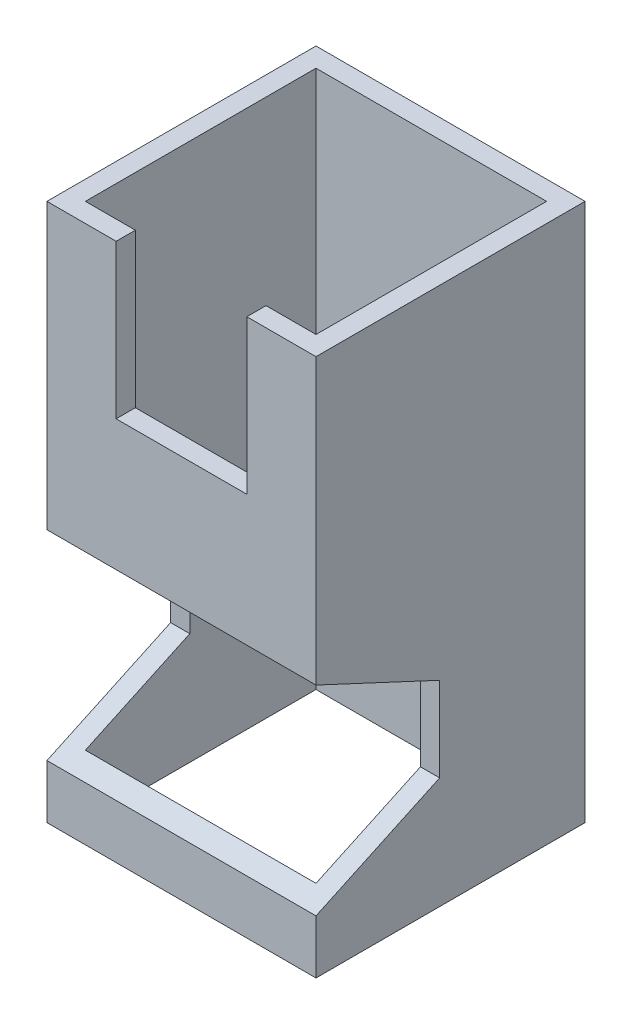
ISO-10303-21;
HEADER;
FILE_DESCRIPTION(('STEP AP214'),'2;1');
FILE_NAME('part.step','',(''),(''),'','','');
FILE_SCHEMA(('AUTOMOTIVE_DESIGN { 1 0 10303 214 1 1 1 1 }'));
ENDSEC;
DATA;
#1=APPLICATION_CONTEXT('core data for automotive mechanical design processes');
#2=APPLICATION_PROTOCOL_DEFINITION('international standard','automotive_design',2000,#1);
#3=PRODUCT_CONTEXT('',#1,'mechanical');
#4=PRODUCT('Part','Part','',(#3));
#5=PRODUCT_RELATED_PRODUCT_CATEGORY('part','',(#4));
#6=PRODUCT_DEFINITION_FORMATION('','',#4);
#7=PRODUCT_DEFINITION_CONTEXT('part definition',#1,'design');
#8=PRODUCT_DEFINITION('design','',#6,#7);
#9=PRODUCT_DEFINITION_SHAPE('','',#8);
#10=(LENGTH_UNIT() NAMED_UNIT(*) SI_UNIT(.MILLI.,.METRE.));
#11=(NAMED_UNIT(*) PLANE_ANGLE_UNIT() SI_UNIT($,.RADIAN.));
#12=(NAMED_UNIT(*) SI_UNIT($,.STERADIAN.) SOLID_ANGLE_UNIT());
#13=UNCERTAINTY_MEASURE_WITH_UNIT(LENGTH_MEASURE(1.E-05),#10,'distance_accuracy_value','');
#14=(GEOMETRIC_REPRESENTATION_CONTEXT(3) GLOBAL_UNCERTAINTY_ASSIGNED_CONTEXT((#13)) GLOBAL_UNIT_ASSIGNED_CONTEXT((#10,
#11,#12)) REPRESENTATION_CONTEXT('',''));
#15=CARTESIAN_POINT('',(0.,0.,0.));
#16=DIRECTION('',(0.,0.,1.));
#17=DIRECTION('',(1.,0.,0.));
#18=AXIS2_PLACEMENT_3D('',#15,#16,#17);
#19=CARTESIAN_POINT('',(-2.5,70.,2.5));
#20=DIRECTION('',(0.,0.,-1.));
#21=DIRECTION('',(-1.,0.,0.));
#22=AXIS2_PLACEMENT_3D('',#19,#20,#21);
#23=PLANE('',#22);
#24=DIRECTION('',(0.,-1.,0.));
#25=VECTOR('',#24,1.);
#26=CARTESIAN_POINT('',(32.5,70.,2.5));
#27=LINE('',#26,#25);
#28=CARTESIAN_POINT('',(32.5,7.,2.5));
#29=VERTEX_POINT('',#28);
#30=CARTESIAN_POINT('',(32.5,0.,2.5));
#31=VERTEX_POINT('',#30);
#32=EDGE_CURVE('E202',#29,#31,#27,.T.);
#33=ORIENTED_EDGE('',*,*,#32,.F.);
#34=DIRECTION('',(-1.,0.,0.));
#35=VECTOR('',#34,1.);
#36=CARTESIAN_POINT('',(32.5,7.,2.5));
#37=LINE('',#36,#35);
#38=CARTESIAN_POINT('',(-2.5,7.,2.5));
#39=VERTEX_POINT('',#38);
#40=EDGE_CURVE('E221',#29,#39,#37,.T.);
#41=ORIENTED_EDGE('',*,*,#40,.T.);
#42=DIRECTION('',(0.,-1.,0.));
#43=VECTOR('',#42,1.);
#44=CARTESIAN_POINT('',(-2.5,70.,2.5));
#45=LINE('',#44,#43);
#46=CARTESIAN_POINT('',(-2.5,0.,2.5));
#47=VERTEX_POINT('',#46);
#48=EDGE_CURVE('E201',#39,#47,#45,.T.);
#49=ORIENTED_EDGE('',*,*,#48,.T.);
#50=DIRECTION('',(1.,0.,0.));
#51=VECTOR('',#50,1.);
#52=CARTESIAN_POINT('',(-2.5,0.,2.5));
#53=LINE('',#52,#51);
#54=EDGE_CURVE('E260',#47,#31,#53,.T.);
#55=ORIENTED_EDGE('',*,*,#54,.T.);
#56=EDGE_LOOP('',(#33,#41,#49,#55));
#57=FACE_BOUND('',#56,.T.);
#58=ADVANCED_FACE('F40',(#57),#23,.F.);
#59=CARTESIAN_POINT('',(0.,70.,0.));
#60=DIRECTION('',(0.,0.,-1.));
#61=DIRECTION('',(-1.,0.,0.));
#62=AXIS2_PLACEMENT_3D('',#59,#60,#61);
#63=PLANE('',#62);
#64=DIRECTION('',(-1.,0.,0.));
#65=VECTOR('',#64,1.);
#66=CARTESIAN_POINT('',(0.,8.16576914538749,0.));
#67=LINE('',#66,#65);
#68=CARTESIAN_POINT('',(30.,8.16576914538748,0.));
#69=VERTEX_POINT('',#68);
#70=CARTESIAN_POINT('',(0.,8.16576914538749,0.));
#71=VERTEX_POINT('',#70);
#72=EDGE_CURVE('E296',#69,#71,#67,.T.);
#73=ORIENTED_EDGE('',*,*,#72,.F.);
#74=DIRECTION('',(0.,-1.,0.));
#75=VECTOR('',#74,1.);
#76=CARTESIAN_POINT('',(30.,70.,0.));
#77=LINE('',#76,#75);
#78=CARTESIAN_POINT('',(30.,0.,0.));
#79=VERTEX_POINT('',#78);
#80=EDGE_CURVE('E227',#69,#79,#77,.T.);
#81=ORIENTED_EDGE('',*,*,#80,.T.);
#82=DIRECTION('',(1.,0.,0.));
#83=VECTOR('',#82,1.);
#84=CARTESIAN_POINT('',(0.,0.,0.));
#85=LINE('',#84,#83);
#86=CARTESIAN_POINT('',(0.,0.,0.));
#87=VERTEX_POINT('',#86);
#88=EDGE_CURVE('E341',#87,#79,#85,.T.);
#89=ORIENTED_EDGE('',*,*,#88,.F.);
#90=DIRECTION('',(0.,-1.,0.));
#91=VECTOR('',#90,1.);
#92=CARTESIAN_POINT('',(0.,70.,0.));
#93=LINE('',#92,#91);
#94=EDGE_CURVE('E237',#71,#87,#93,.T.);
#95=ORIENTED_EDGE('',*,*,#94,.F.);
#96=EDGE_LOOP('',(#73,#81,#89,#95));
#97=FACE_BOUND('',#96,.T.);
#98=ADVANCED_FACE('F354',(#97),#63,.T.);
#99=CARTESIAN_POINT('',(0.,70.,0.));
#100=DIRECTION('',(0.,1.,0.));
#101=DIRECTION('',(0.,0.,1.));
#102=AXIS2_PLACEMENT_3D('',#99,#100,#101);
#103=PLANE('',#102);
#104=DIRECTION('',(0.,0.,1.));
#105=VECTOR('',#104,1.);
#106=CARTESIAN_POINT('',(23.5,70.,-26.2488094968134));
#107=LINE('',#106,#105);
#108=CARTESIAN_POINT('',(23.5,70.,0.));
#109=VERTEX_POINT('',#108);
#110=CARTESIAN_POINT('',(23.5,70.,2.5));
#111=VERTEX_POINT('',#110);
#112=EDGE_CURVE('E320',#109,#111,#107,.T.);
#113=ORIENTED_EDGE('',*,*,#112,.T.);
#114=DIRECTION('',(1.,0.,0.));
#115=VECTOR('',#114,1.);
#116=CARTESIAN_POINT('',(-2.5,70.,2.5));
#117=LINE('',#116,#115);
#118=CARTESIAN_POINT('',(32.5,70.,2.5));
#119=VERTEX_POINT('',#118);
#120=EDGE_CURVE('E249',#111,#119,#117,.T.);
#121=ORIENTED_EDGE('',*,*,#120,.T.);
#122=DIRECTION('',(0.,0.,-1.));
#123=VECTOR('',#122,1.);
#124=CARTESIAN_POINT('',(32.5,70.,-32.5));
#125=LINE('',#124,#123);
#126=CARTESIAN_POINT('',(32.5,70.,-32.5));
#127=VERTEX_POINT('',#126);
#128=EDGE_CURVE('E200',#119,#127,#125,.T.);
#129=ORIENTED_EDGE('',*,*,#128,.T.);
#130=DIRECTION('',(-1.,0.,0.));
#131=VECTOR('',#130,1.);
#132=CARTESIAN_POINT('',(-2.5,70.,-32.5));
#133=LINE('',#132,#131);
#134=CARTESIAN_POINT('',(-2.5,70.,-32.5));
#135=VERTEX_POINT('',#134);
#136=EDGE_CURVE('E255',#127,#135,#133,.T.);
#137=ORIENTED_EDGE('',*,*,#136,.T.);
#138=DIRECTION('',(0.,0.,1.));
#139=VECTOR('',#138,1.);
#140=CARTESIAN_POINT('',(-2.5,70.,-32.5));
#141=LINE('',#140,#139);
#142=CARTESIAN_POINT('',(-2.5,70.,2.5));
#143=VERTEX_POINT('',#142);
#144=EDGE_CURVE('E246',#135,#143,#141,.T.);
#145=ORIENTED_EDGE('',*,*,#144,.T.);
#146=CARTESIAN_POINT('',(6.5,70.,2.5));
#147=VERTEX_POINT('',#146);
#148=EDGE_CURVE('E251',#143,#147,#117,.T.);
#149=ORIENTED_EDGE('',*,*,#148,.T.);
#150=DIRECTION('',(0.,0.,1.));
#151=VECTOR('',#150,1.);
#152=CARTESIAN_POINT('',(6.5,70.,-26.2488094968134));
#153=LINE('',#152,#151);
#154=CARTESIAN_POINT('',(6.5,70.,0.));
#155=VERTEX_POINT('',#154);
#156=EDGE_CURVE('E316',#155,#147,#153,.T.);
#157=ORIENTED_EDGE('',*,*,#156,.F.);
#158=DIRECTION('',(1.,0.,0.));
#159=VECTOR('',#158,1.);
#160=CARTESIAN_POINT('',(0.,70.,0.));
#161=LINE('',#160,#159);
#162=CARTESIAN_POINT('',(0.,70.,0.));
#163=VERTEX_POINT('',#162);
#164=EDGE_CURVE('E331',#163,#155,#161,.T.);
#165=ORIENTED_EDGE('',*,*,#164,.F.);
#166=DIRECTION('',(0.,0.,1.));
#167=VECTOR('',#166,1.);
#168=CARTESIAN_POINT('',(0.,70.,0.));
#169=LINE('',#168,#167);
#170=CARTESIAN_POINT('',(0.,70.,-30.));
#171=VERTEX_POINT('',#170);
#172=EDGE_CURVE('E327',#171,#163,#169,.T.);
#173=ORIENTED_EDGE('',*,*,#172,.F.);
#174=DIRECTION('',(-1.,0.,0.));
#175=VECTOR('',#174,1.);
#176=CARTESIAN_POINT('',(0.,70.,-30.));
#177=LINE('',#176,#175);
#178=CARTESIAN_POINT('',(30.,70.,-30.));
#179=VERTEX_POINT('',#178);
#180=EDGE_CURVE('E337',#179,#171,#177,.T.);
#181=ORIENTED_EDGE('',*,*,#180,.F.);
#182=DIRECTION('',(0.,0.,-1.));
#183=VECTOR('',#182,1.);
#184=CARTESIAN_POINT('',(30.,70.,0.));
#185=LINE('',#184,#183);
#186=CARTESIAN_POINT('',(30.,70.,0.));
#187=VERTEX_POINT('',#186);
#188=EDGE_CURVE('E334',#187,#179,#185,.T.);
#189=ORIENTED_EDGE('',*,*,#188,.F.);
#190=EDGE_CURVE('E329',#109,#187,#161,.T.);
#191=ORIENTED_EDGE('',*,*,#190,.F.);
#192=EDGE_LOOP('',(#113,#121,#129,#137,#145,#149,#157,#165,#173,#181,#189,#191));
#193=FACE_BOUND('',#192,.T.);
#194=ADVANCED_FACE('F370',(#193),#103,.T.);
#195=CARTESIAN_POINT('',(0.,0.,0.));
#196=DIRECTION('',(0.,1.,0.));
#197=DIRECTION('',(0.,0.,1.));
#198=AXIS2_PLACEMENT_3D('',#195,#196,#197);
#199=PLANE('',#198);
#200=DIRECTION('',(0.,0.,1.));
#201=VECTOR('',#200,1.);
#202=CARTESIAN_POINT('',(-2.5,0.,-32.5));
#203=LINE('',#202,#201);
#204=CARTESIAN_POINT('',(-2.5,0.,-32.5));
#205=VERTEX_POINT('',#204);
#206=EDGE_CURVE('E245',#205,#47,#203,.T.);
#207=ORIENTED_EDGE('',*,*,#206,.F.);
#208=DIRECTION('',(-1.,0.,0.));
#209=VECTOR('',#208,1.);
#210=CARTESIAN_POINT('',(-2.5,0.,-32.5));
#211=LINE('',#210,#209);
#212=CARTESIAN_POINT('',(32.5,0.,-32.5));
#213=VERTEX_POINT('',#212);
#214=EDGE_CURVE('E250',#213,#205,#211,.T.);
#215=ORIENTED_EDGE('',*,*,#214,.F.);
#216=DIRECTION('',(0.,0.,-1.));
#217=VECTOR('',#216,1.);
#218=CARTESIAN_POINT('',(32.5,0.,-32.5));
#219=LINE('',#218,#217);
#220=EDGE_CURVE('E263',#31,#213,#219,.T.);
#221=ORIENTED_EDGE('',*,*,#220,.F.);
#222=ORIENTED_EDGE('',*,*,#54,.F.);
#223=EDGE_LOOP('',(#207,#215,#221,#222));
#224=FACE_BOUND('',#223,.T.);
#225=DIRECTION('',(0.,0.,1.));
#226=VECTOR('',#225,1.);
#227=CARTESIAN_POINT('',(0.,0.,0.));
#228=LINE('',#227,#226);
#229=CARTESIAN_POINT('',(0.,0.,-30.));
#230=VERTEX_POINT('',#229);
#231=EDGE_CURVE('E326',#230,#87,#228,.T.);
#232=ORIENTED_EDGE('',*,*,#231,.T.);
#233=ORIENTED_EDGE('',*,*,#88,.T.);
#234=DIRECTION('',(0.,0.,-1.));
#235=VECTOR('',#234,1.);
#236=CARTESIAN_POINT('',(30.,0.,0.));
#237=LINE('',#236,#235);
#238=CARTESIAN_POINT('',(30.,0.,-30.));
#239=VERTEX_POINT('',#238);
#240=EDGE_CURVE('E229',#79,#239,#237,.T.);
#241=ORIENTED_EDGE('',*,*,#240,.T.);
#242=DIRECTION('',(-1.,0.,0.));
#243=VECTOR('',#242,1.);
#244=CARTESIAN_POINT('',(0.,0.,-30.));
#245=LINE('',#244,#243);
#246=EDGE_CURVE('E330',#239,#230,#245,.T.);
#247=ORIENTED_EDGE('',*,*,#246,.T.);
#248=EDGE_LOOP('',(#232,#233,#241,#247));
#249=FACE_BOUND('',#248,.T.);
#250=ADVANCED_FACE('F277',(#224,#249),#199,.F.);
#251=CARTESIAN_POINT('',(-2.5,70.,-32.5));
#252=DIRECTION('',(1.,0.,0.));
#253=DIRECTION('',(0.,0.,-1.));
#254=AXIS2_PLACEMENT_3D('',#251,#252,#253);
#255=PLANE('',#254);
#256=ORIENTED_EDGE('',*,*,#48,.F.);
#257=DIRECTION('',(0.,-0.422618261740698,0.906307787036651));
#258=VECTOR('',#257,1.);
#259=CARTESIAN_POINT('',(-2.5,14.5,-13.5838019038218));
#260=LINE('',#259,#258);
#261=CARTESIAN_POINT('',(-2.5,14.5,-13.5838019038218));
#262=VERTEX_POINT('',#261);
#263=EDGE_CURVE('E184',#262,#39,#260,.T.);
#264=ORIENTED_EDGE('',*,*,#263,.F.);
#265=DIRECTION('',(0.,-1.,0.));
#266=VECTOR('',#265,1.);
#267=CARTESIAN_POINT('',(-2.5,25.5,-13.5838019038218));
#268=LINE('',#267,#266);
#269=CARTESIAN_POINT('',(-2.5,25.5,-13.5838019038218));
#270=VERTEX_POINT('',#269);
#271=EDGE_CURVE('E364',#270,#262,#268,.T.);
#272=ORIENTED_EDGE('',*,*,#271,.F.);
#273=DIRECTION('',(0.,-0.422618261740697,-0.906307787036651));
#274=VECTOR('',#273,1.);
#275=CARTESIAN_POINT('',(-2.5,33.,2.50000000000001));
#276=LINE('',#275,#274);
#277=CARTESIAN_POINT('',(-2.5,33.,2.50000000000001));
#278=VERTEX_POINT('',#277);
#279=EDGE_CURVE('E365',#278,#270,#276,.T.);
#280=ORIENTED_EDGE('',*,*,#279,.F.);
#281=EDGE_CURVE('E194',#143,#278,#45,.T.);
#282=ORIENTED_EDGE('',*,*,#281,.F.);
#283=ORIENTED_EDGE('',*,*,#144,.F.);
#284=DIRECTION('',(0.,-1.,0.));
#285=VECTOR('',#284,1.);
#286=CARTESIAN_POINT('',(-2.5,70.,-32.5));
#287=LINE('',#286,#285);
#288=EDGE_CURVE('E257',#135,#205,#287,.T.);
#289=ORIENTED_EDGE('',*,*,#288,.T.);
#290=ORIENTED_EDGE('',*,*,#206,.T.);
#291=EDGE_LOOP('',(#256,#264,#272,#280,#282,#283,#289,#290));
#292=FACE_BOUND('',#291,.T.);
#293=ADVANCED_FACE('F42',(#292),#255,.F.);
#294=ORIENTED_EDGE('',*,*,#281,.T.);
#295=DIRECTION('',(-1.,0.,0.));
#296=VECTOR('',#295,1.);
#297=CARTESIAN_POINT('',(32.5,33.,2.5));
#298=LINE('',#297,#296);
#299=CARTESIAN_POINT('',(32.5,33.,2.5));
#300=VERTEX_POINT('',#299);
#301=EDGE_CURVE('E179',#300,#278,#298,.T.);
#302=ORIENTED_EDGE('',*,*,#301,.F.);
#303=EDGE_CURVE('E191',#119,#300,#27,.T.);
#304=ORIENTED_EDGE('',*,*,#303,.F.);
#305=ORIENTED_EDGE('',*,*,#120,.F.);
#306=DIRECTION('',(0.,1.,0.));
#307=VECTOR('',#306,1.);
#308=CARTESIAN_POINT('',(23.5,70.,2.5));
#309=LINE('',#308,#307);
#310=CARTESIAN_POINT('',(23.5,50.,2.5));
#311=VERTEX_POINT('',#310);
#312=EDGE_CURVE('E301',#311,#111,#309,.T.);
#313=ORIENTED_EDGE('',*,*,#312,.F.);
#314=DIRECTION('',(1.,0.,0.));
#315=VECTOR('',#314,1.);
#316=CARTESIAN_POINT('',(6.5,50.,2.5));
#317=LINE('',#316,#315);
#318=CARTESIAN_POINT('',(6.5,50.,2.5));
#319=VERTEX_POINT('',#318);
#320=EDGE_CURVE('E304',#319,#311,#317,.T.);
#321=ORIENTED_EDGE('',*,*,#320,.F.);
#322=DIRECTION('',(0.,-1.,0.));
#323=VECTOR('',#322,1.);
#324=CARTESIAN_POINT('',(6.5,70.,2.5));
#325=LINE('',#324,#323);
#326=EDGE_CURVE('E300',#147,#319,#325,.T.);
#327=ORIENTED_EDGE('',*,*,#326,.F.);
#328=ORIENTED_EDGE('',*,*,#148,.F.);
#329=EDGE_LOOP('',(#294,#302,#304,#305,#313,#321,#327,#328));
#330=FACE_BOUND('',#329,.T.);
#331=ADVANCED_FACE('F189',(#330),#23,.F.);
#332=CARTESIAN_POINT('',(32.5,70.,-32.5));
#333=DIRECTION('',(-1.,0.,0.));
#334=DIRECTION('',(0.,0.,1.));
#335=AXIS2_PLACEMENT_3D('',#332,#333,#334);
#336=PLANE('',#335);
#337=DIRECTION('',(0.,-1.,0.));
#338=VECTOR('',#337,1.);
#339=CARTESIAN_POINT('',(32.5,25.5,-13.5838019038218));
#340=LINE('',#339,#338);
#341=CARTESIAN_POINT('',(32.5,25.5,-13.5838019038218));
#342=VERTEX_POINT('',#341);
#343=CARTESIAN_POINT('',(32.5,14.5,-13.5838019038218));
#344=VERTEX_POINT('',#343);
#345=EDGE_CURVE('E55',#342,#344,#340,.T.);
#346=ORIENTED_EDGE('',*,*,#345,.T.);
#347=DIRECTION('',(0.,-0.422618261740698,0.906307787036651));
#348=VECTOR('',#347,1.);
#349=CARTESIAN_POINT('',(32.5,14.5,-13.5838019038218));
#350=LINE('',#349,#348);
#351=EDGE_CURVE('E196',#344,#29,#350,.T.);
#352=ORIENTED_EDGE('',*,*,#351,.T.);
#353=ORIENTED_EDGE('',*,*,#32,.T.);
#354=ORIENTED_EDGE('',*,*,#220,.T.);
#355=DIRECTION('',(0.,-1.,0.));
#356=VECTOR('',#355,1.);
#357=CARTESIAN_POINT('',(32.5,70.,-32.5));
#358=LINE('',#357,#356);
#359=EDGE_CURVE('E205',#127,#213,#358,.T.);
#360=ORIENTED_EDGE('',*,*,#359,.F.);
#361=ORIENTED_EDGE('',*,*,#128,.F.);
#362=ORIENTED_EDGE('',*,*,#303,.T.);
#363=DIRECTION('',(0.,-0.422618261740697,-0.906307787036651));
#364=VECTOR('',#363,1.);
#365=CARTESIAN_POINT('',(32.5,33.,2.5));
#366=LINE('',#365,#364);
#367=EDGE_CURVE('E175',#300,#342,#366,.T.);
#368=ORIENTED_EDGE('',*,*,#367,.T.);
#369=EDGE_LOOP('',(#346,#352,#353,#354,#360,#361,#362,#368));
#370=FACE_BOUND('',#369,.T.);
#371=ADVANCED_FACE('F198',(#370),#336,.F.);
#372=CARTESIAN_POINT('',(-2.5,70.,-32.5));
#373=DIRECTION('',(0.,0.,1.));
#374=DIRECTION('',(1.,0.,0.));
#375=AXIS2_PLACEMENT_3D('',#372,#373,#374);
#376=PLANE('',#375);
#377=ORIENTED_EDGE('',*,*,#214,.T.);
#378=ORIENTED_EDGE('',*,*,#288,.F.);
#379=ORIENTED_EDGE('',*,*,#136,.F.);
#380=ORIENTED_EDGE('',*,*,#359,.T.);
#381=EDGE_LOOP('',(#377,#378,#379,#380));
#382=FACE_BOUND('',#381,.T.);
#383=ADVANCED_FACE('F274',(#382),#376,.F.);
#384=CARTESIAN_POINT('',(0.,70.,0.));
#385=DIRECTION('',(1.,0.,0.));
#386=DIRECTION('',(0.,0.,-1.));
#387=AXIS2_PLACEMENT_3D('',#384,#385,#386);
#388=PLANE('',#387);
#389=DIRECTION('',(0.,0.422618261740698,-0.906307787036651));
#390=VECTOR('',#389,1.);
#391=CARTESIAN_POINT('',(0.,19.2097458487726,-23.6838844703559));
#392=LINE('',#391,#390);
#393=CARTESIAN_POINT('',(0.,14.5,-13.5838019038218));
#394=VERTEX_POINT('',#393);
#395=EDGE_CURVE('E298',#71,#394,#392,.T.);
#396=ORIENTED_EDGE('',*,*,#395,.F.);
#397=ORIENTED_EDGE('',*,*,#94,.T.);
#398=ORIENTED_EDGE('',*,*,#231,.F.);
#399=DIRECTION('',(0.,-1.,0.));
#400=VECTOR('',#399,1.);
#401=CARTESIAN_POINT('',(0.,70.,-30.));
#402=LINE('',#401,#400);
#403=EDGE_CURVE('E238',#171,#230,#402,.T.);
#404=ORIENTED_EDGE('',*,*,#403,.F.);
#405=ORIENTED_EDGE('',*,*,#172,.T.);
#406=CARTESIAN_POINT('',(0.,31.8342308546125,0.));
#407=VERTEX_POINT('',#406);
#408=EDGE_CURVE('E242',#163,#407,#93,.T.);
#409=ORIENTED_EDGE('',*,*,#408,.T.);
#410=DIRECTION('',(0.,0.422618261740697,0.906307787036651));
#411=VECTOR('',#410,1.);
#412=CARTESIAN_POINT('',(0.,38.6508736669002,14.6183376855929));
#413=LINE('',#412,#411);
#414=CARTESIAN_POINT('',(0.,25.5,-13.5838019038218));
#415=VERTEX_POINT('',#414);
#416=EDGE_CURVE('E287',#415,#407,#413,.T.);
#417=ORIENTED_EDGE('',*,*,#416,.F.);
#418=DIRECTION('',(0.,1.,0.));
#419=VECTOR('',#418,1.);
#420=CARTESIAN_POINT('',(0.,70.,-13.5838019038218));
#421=LINE('',#420,#419);
#422=EDGE_CURVE('E294',#394,#415,#421,.T.);
#423=ORIENTED_EDGE('',*,*,#422,.F.);
#424=EDGE_LOOP('',(#396,#397,#398,#404,#405,#409,#417,#423));
#425=FACE_BOUND('',#424,.T.);
#426=ADVANCED_FACE('F356',(#425),#388,.T.);
#427=DIRECTION('',(1.,0.,0.));
#428=VECTOR('',#427,1.);
#429=CARTESIAN_POINT('',(0.,31.8342308546125,0.));
#430=LINE('',#429,#428);
#431=CARTESIAN_POINT('',(30.,31.8342308546125,0.));
#432=VERTEX_POINT('',#431);
#433=EDGE_CURVE('E63',#407,#432,#430,.T.);
#434=ORIENTED_EDGE('',*,*,#433,.F.);
#435=ORIENTED_EDGE('',*,*,#408,.F.);
#436=ORIENTED_EDGE('',*,*,#164,.T.);
#437=DIRECTION('',(0.,-1.,0.));
#438=VECTOR('',#437,1.);
#439=CARTESIAN_POINT('',(6.5,70.,0.));
#440=LINE('',#439,#438);
#441=CARTESIAN_POINT('',(6.5,50.,0.));
#442=VERTEX_POINT('',#441);
#443=EDGE_CURVE('E312',#155,#442,#440,.T.);
#444=ORIENTED_EDGE('',*,*,#443,.T.);
#445=DIRECTION('',(1.,0.,0.));
#446=VECTOR('',#445,1.);
#447=CARTESIAN_POINT('',(6.5,50.,0.));
#448=LINE('',#447,#446);
#449=CARTESIAN_POINT('',(23.5,50.,0.));
#450=VERTEX_POINT('',#449);
#451=EDGE_CURVE('E303',#442,#450,#448,.T.);
#452=ORIENTED_EDGE('',*,*,#451,.T.);
#453=DIRECTION('',(0.,1.,0.));
#454=VECTOR('',#453,1.);
#455=CARTESIAN_POINT('',(23.5,70.,0.));
#456=LINE('',#455,#454);
#457=EDGE_CURVE('E317',#450,#109,#456,.T.);
#458=ORIENTED_EDGE('',*,*,#457,.T.);
#459=ORIENTED_EDGE('',*,*,#190,.T.);
#460=EDGE_CURVE('E233',#187,#432,#77,.T.);
#461=ORIENTED_EDGE('',*,*,#460,.T.);
#462=EDGE_LOOP('',(#434,#435,#436,#444,#452,#458,#459,#461));
#463=FACE_BOUND('',#462,.T.);
#464=ADVANCED_FACE('F387',(#463),#63,.T.);
#465=CARTESIAN_POINT('',(30.,70.,0.));
#466=DIRECTION('',(-1.,0.,0.));
#467=DIRECTION('',(0.,0.,1.));
#468=AXIS2_PLACEMENT_3D('',#465,#466,#467);
#469=PLANE('',#468);
#470=DIRECTION('',(0.,-0.422618261740698,0.906307787036651));
#471=VECTOR('',#470,1.);
#472=CARTESIAN_POINT('',(30.,19.2097458487726,-23.6838844703559));
#473=LINE('',#472,#471);
#474=CARTESIAN_POINT('',(30.,14.5,-13.5838019038218));
#475=VERTEX_POINT('',#474);
#476=EDGE_CURVE('E11',#475,#69,#473,.T.);
#477=ORIENTED_EDGE('',*,*,#476,.F.);
#478=DIRECTION('',(0.,-1.,0.));
#479=VECTOR('',#478,1.);
#480=CARTESIAN_POINT('',(30.,70.,-13.5838019038218));
#481=LINE('',#480,#479);
#482=CARTESIAN_POINT('',(30.,25.5,-13.5838019038218));
#483=VERTEX_POINT('',#482);
#484=EDGE_CURVE('E48',#483,#475,#481,.T.);
#485=ORIENTED_EDGE('',*,*,#484,.F.);
#486=DIRECTION('',(0.,-0.422618261740697,-0.906307787036651));
#487=VECTOR('',#486,1.);
#488=CARTESIAN_POINT('',(30.,38.6508736669002,14.6183376855929));
#489=LINE('',#488,#487);
#490=EDGE_CURVE('E209',#432,#483,#489,.T.);
#491=ORIENTED_EDGE('',*,*,#490,.F.);
#492=ORIENTED_EDGE('',*,*,#460,.F.);
#493=ORIENTED_EDGE('',*,*,#188,.T.);
#494=DIRECTION('',(0.,-1.,0.));
#495=VECTOR('',#494,1.);
#496=CARTESIAN_POINT('',(30.,70.,-30.));
#497=LINE('',#496,#495);
#498=EDGE_CURVE('E234',#179,#239,#497,.T.);
#499=ORIENTED_EDGE('',*,*,#498,.T.);
#500=ORIENTED_EDGE('',*,*,#240,.F.);
#501=ORIENTED_EDGE('',*,*,#80,.F.);
#502=EDGE_LOOP('',(#477,#485,#491,#492,#493,#499,#500,#501));
#503=FACE_BOUND('',#502,.T.);
#504=ADVANCED_FACE('F225',(#503),#469,.T.);
#505=CARTESIAN_POINT('',(0.,70.,-30.));
#506=DIRECTION('',(0.,0.,1.));
#507=DIRECTION('',(1.,0.,0.));
#508=AXIS2_PLACEMENT_3D('',#505,#506,#507);
#509=PLANE('',#508);
#510=ORIENTED_EDGE('',*,*,#246,.F.);
#511=ORIENTED_EDGE('',*,*,#498,.F.);
#512=ORIENTED_EDGE('',*,*,#180,.T.);
#513=ORIENTED_EDGE('',*,*,#403,.T.);
#514=EDGE_LOOP('',(#510,#511,#512,#513));
#515=FACE_BOUND('',#514,.T.);
#516=ADVANCED_FACE('F349',(#515),#509,.T.);
#517=CARTESIAN_POINT('',(6.5,50.,-26.2488094968134));
#518=DIRECTION('',(0.,-1.,0.));
#519=DIRECTION('',(0.,0.,-1.));
#520=AXIS2_PLACEMENT_3D('',#517,#518,#519);
#521=PLANE('',#520);
#522=DIRECTION('',(0.,0.,1.));
#523=VECTOR('',#522,1.);
#524=CARTESIAN_POINT('',(6.5,50.,-26.2488094968134));
#525=LINE('',#524,#523);
#526=EDGE_CURVE('E315',#442,#319,#525,.T.);
#527=ORIENTED_EDGE('',*,*,#526,.T.);
#528=ORIENTED_EDGE('',*,*,#320,.T.);
#529=DIRECTION('',(0.,0.,1.));
#530=VECTOR('',#529,1.);
#531=CARTESIAN_POINT('',(23.5,50.,-26.2488094968134));
#532=LINE('',#531,#530);
#533=EDGE_CURVE('E311',#450,#311,#532,.T.);
#534=ORIENTED_EDGE('',*,*,#533,.F.);
#535=ORIENTED_EDGE('',*,*,#451,.F.);
#536=EDGE_LOOP('',(#527,#528,#534,#535));
#537=FACE_BOUND('',#536,.T.);
#538=ADVANCED_FACE('F381',(#537),#521,.F.);
#539=CARTESIAN_POINT('',(23.5,70.,-26.2488094968134));
#540=DIRECTION('',(1.,0.,0.));
#541=DIRECTION('',(0.,1.,0.));
#542=AXIS2_PLACEMENT_3D('',#539,#540,#541);
#543=PLANE('',#542);
#544=ORIENTED_EDGE('',*,*,#533,.T.);
#545=ORIENTED_EDGE('',*,*,#312,.T.);
#546=ORIENTED_EDGE('',*,*,#112,.F.);
#547=ORIENTED_EDGE('',*,*,#457,.F.);
#548=EDGE_LOOP('',(#544,#545,#546,#547));
#549=FACE_BOUND('',#548,.T.);
#550=ADVANCED_FACE('F377',(#549),#543,.F.);
#551=CARTESIAN_POINT('',(6.5,70.,-26.2488094968134));
#552=DIRECTION('',(-1.,0.,0.));
#553=DIRECTION('',(0.,-1.,0.));
#554=AXIS2_PLACEMENT_3D('',#551,#552,#553);
#555=PLANE('',#554);
#556=ORIENTED_EDGE('',*,*,#156,.T.);
#557=ORIENTED_EDGE('',*,*,#326,.T.);
#558=ORIENTED_EDGE('',*,*,#526,.F.);
#559=ORIENTED_EDGE('',*,*,#443,.F.);
#560=EDGE_LOOP('',(#556,#557,#558,#559));
#561=FACE_BOUND('',#560,.T.);
#562=ADVANCED_FACE('F383',(#561),#555,.F.);
#563=CARTESIAN_POINT('',(32.5,25.5,-13.5838019038218));
#564=DIRECTION('',(0.,0.,-1.));
#565=DIRECTION('',(0.,1.,0.));
#566=AXIS2_PLACEMENT_3D('',#563,#564,#565);
#567=PLANE('',#566);
#568=ORIENTED_EDGE('',*,*,#422,.T.);
#569=DIRECTION('',(-1.,0.,0.));
#570=VECTOR('',#569,1.);
#571=CARTESIAN_POINT('',(32.5,25.5,-13.5838019038218));
#572=LINE('',#571,#570);
#573=EDGE_CURVE('E195',#415,#270,#572,.T.);
#574=ORIENTED_EDGE('',*,*,#573,.T.);
#575=ORIENTED_EDGE('',*,*,#271,.T.);
#576=DIRECTION('',(-1.,0.,0.));
#577=VECTOR('',#576,1.);
#578=CARTESIAN_POINT('',(32.5,14.5,-13.5838019038218));
#579=LINE('',#578,#577);
#580=EDGE_CURVE('E222',#394,#262,#579,.T.);
#581=ORIENTED_EDGE('',*,*,#580,.F.);
#582=EDGE_LOOP('',(#568,#574,#575,#581));
#583=FACE_BOUND('',#582,.T.);
#584=ADVANCED_FACE('F362',(#583),#567,.F.);
#585=CARTESIAN_POINT('',(32.5,14.5,-13.5838019038218));
#586=DIRECTION('',(0.,-0.906307787036651,-0.422618261740698));
#587=DIRECTION('',(0.,0.422618261740698,-0.906307787036651));
#588=AXIS2_PLACEMENT_3D('',#585,#586,#587);
#589=PLANE('',#588);
#590=ORIENTED_EDGE('',*,*,#395,.T.);
#591=ORIENTED_EDGE('',*,*,#580,.T.);
#592=ORIENTED_EDGE('',*,*,#263,.T.);
#593=ORIENTED_EDGE('',*,*,#40,.F.);
#594=ORIENTED_EDGE('',*,*,#351,.F.);
#595=EDGE_CURVE('E213',#344,#475,#579,.T.);
#596=ORIENTED_EDGE('',*,*,#595,.T.);
#597=ORIENTED_EDGE('',*,*,#476,.T.);
#598=ORIENTED_EDGE('',*,*,#72,.T.);
#599=EDGE_LOOP('',(#590,#591,#592,#593,#594,#596,#597,#598));
#600=FACE_BOUND('',#599,.T.);
#601=ADVANCED_FACE('F218',(#600),#589,.F.);
#602=ORIENTED_EDGE('',*,*,#484,.T.);
#603=ORIENTED_EDGE('',*,*,#595,.F.);
#604=ORIENTED_EDGE('',*,*,#345,.F.);
#605=EDGE_CURVE('E181',#342,#483,#572,.T.);
#606=ORIENTED_EDGE('',*,*,#605,.T.);
#607=EDGE_LOOP('',(#602,#603,#604,#606));
#608=FACE_BOUND('',#607,.T.);
#609=ADVANCED_FACE('F212',(#608),#567,.F.);
#610=CARTESIAN_POINT('',(32.5,33.,2.5));
#611=DIRECTION('',(0.,0.906307787036651,-0.422618261740697));
#612=DIRECTION('',(0.,0.422618261740697,0.906307787036651));
#613=AXIS2_PLACEMENT_3D('',#610,#611,#612);
#614=PLANE('',#613);
#615=ORIENTED_EDGE('',*,*,#416,.T.);
#616=ORIENTED_EDGE('',*,*,#433,.T.);
#617=ORIENTED_EDGE('',*,*,#490,.T.);
#618=ORIENTED_EDGE('',*,*,#605,.F.);
#619=ORIENTED_EDGE('',*,*,#367,.F.);
#620=ORIENTED_EDGE('',*,*,#301,.T.);
#621=ORIENTED_EDGE('',*,*,#279,.T.);
#622=ORIENTED_EDGE('',*,*,#573,.F.);
#623=EDGE_LOOP('',(#615,#616,#617,#618,#619,#620,#621,#622));
#624=FACE_BOUND('',#623,.T.);
#625=ADVANCED_FACE('F177',(#624),#614,.F.);
#626=CLOSED_SHELL('',(#58,#98,#194,#250,#293,#331,#371,#383,#426,#464,#504,#516,#538,#550,#562,
#584,#601,#609,#625));
#627=MANIFOLD_SOLID_BREP('B2',#626);
#628=ADVANCED_BREP_SHAPE_REPRESENTATION('',(#18,#627),#14);
#629=SHAPE_DEFINITION_REPRESENTATION(#9,#628);
ENDSEC;
END-ISO-10303-21;
